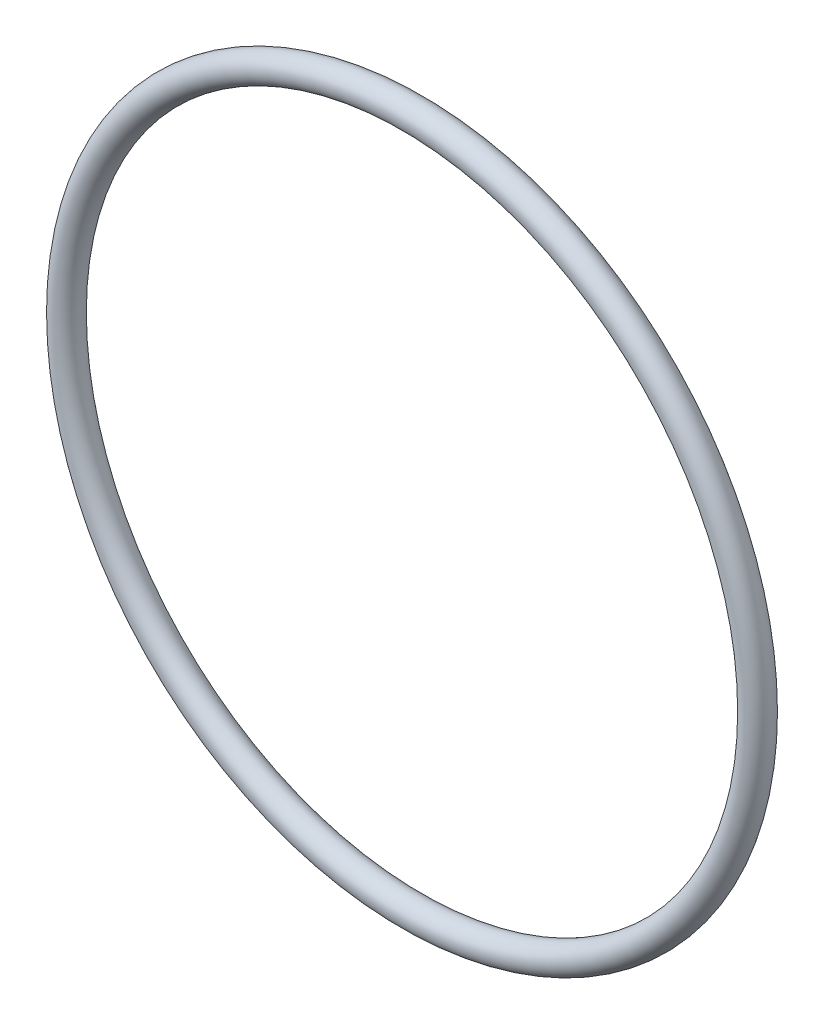
ISO-10303-21;
HEADER;
FILE_DESCRIPTION(('STEP AP214'),'2;1');
FILE_NAME('part.step','',(''),(''),'','','');
FILE_SCHEMA(('AUTOMOTIVE_DESIGN { 1 0 10303 214 1 1 1 1 }'));
ENDSEC;
DATA;
#1=APPLICATION_CONTEXT('core data for automotive mechanical design processes');
#2=APPLICATION_PROTOCOL_DEFINITION('international standard','automotive_design',2000,#1);
#3=PRODUCT_CONTEXT('',#1,'mechanical');
#4=PRODUCT('Part','Part','',(#3));
#5=PRODUCT_RELATED_PRODUCT_CATEGORY('part','',(#4));
#6=PRODUCT_DEFINITION_FORMATION('','',#4);
#7=PRODUCT_DEFINITION_CONTEXT('part definition',#1,'design');
#8=PRODUCT_DEFINITION('design','',#6,#7);
#9=PRODUCT_DEFINITION_SHAPE('','',#8);
#10=(LENGTH_UNIT() NAMED_UNIT(*) SI_UNIT(.MILLI.,.METRE.));
#11=(NAMED_UNIT(*) PLANE_ANGLE_UNIT() SI_UNIT($,.RADIAN.));
#12=(NAMED_UNIT(*) SI_UNIT($,.STERADIAN.) SOLID_ANGLE_UNIT());
#13=UNCERTAINTY_MEASURE_WITH_UNIT(LENGTH_MEASURE(1.E-05),#10,'distance_accuracy_value','');
#14=(GEOMETRIC_REPRESENTATION_CONTEXT(3) GLOBAL_UNCERTAINTY_ASSIGNED_CONTEXT((#13)) GLOBAL_UNIT_ASSIGNED_CONTEXT((#10,
#11,#12)) REPRESENTATION_CONTEXT('',''));
#15=CARTESIAN_POINT('',(0.,0.,0.));
#16=DIRECTION('',(0.,0.,1.));
#17=DIRECTION('',(1.,0.,0.));
#18=AXIS2_PLACEMENT_3D('',#15,#16,#17);
#19=CARTESIAN_POINT('',(0.,0.,0.));
#20=DIRECTION('',(0.,0.,1.));
#21=DIRECTION('',(1.,0.,0.));
#22=AXIS2_PLACEMENT_3D('',#19,#20,#21);
#23=TOROIDAL_SURFACE('',#22,32.1056,1.3081);
#24=CARTESIAN_POINT('',(33.4137,0.,0.));
#25=VERTEX_POINT('',#24);
#26=VERTEX_LOOP('',#25);
#27=FACE_BOUND('',#26,.T.);
#28=ADVANCED_FACE('F30',(#27),#23,.T.);
#29=CLOSED_SHELL('',(#28));
#30=MANIFOLD_SOLID_BREP('B2',#29);
#31=ADVANCED_BREP_SHAPE_REPRESENTATION('',(#18,#30),#14);
#32=SHAPE_DEFINITION_REPRESENTATION(#9,#31);
ENDSEC;
END-ISO-10303-21;
